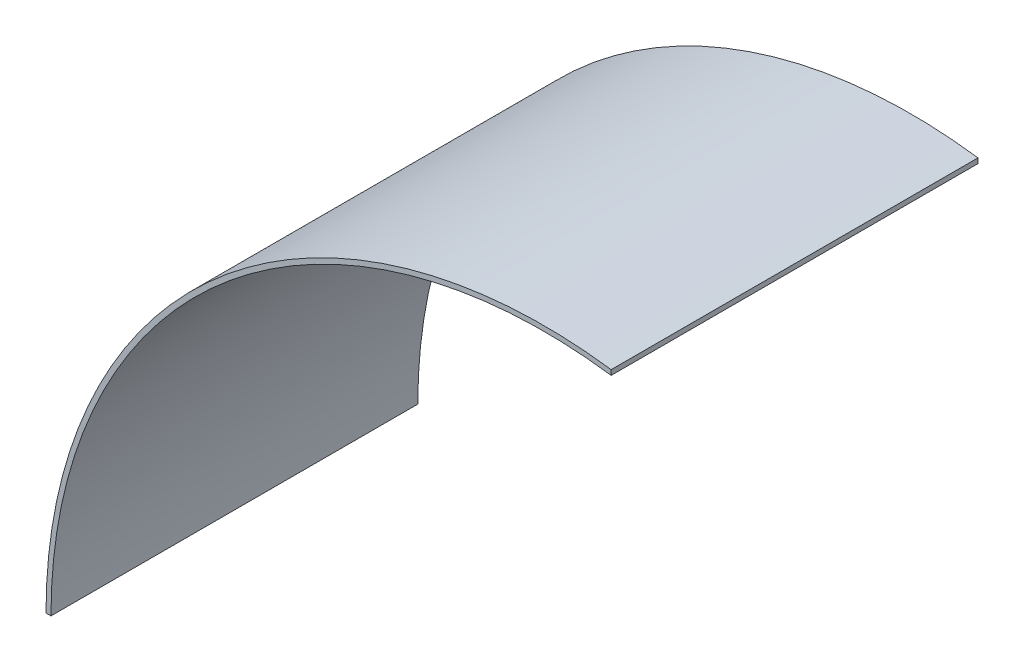
ISO-10303-21;
HEADER;
FILE_DESCRIPTION(('STEP AP214'),'2;1');
FILE_NAME('part.step','',(''),(''),'','','');
FILE_SCHEMA(('AUTOMOTIVE_DESIGN { 1 0 10303 214 1 1 1 1 }'));
ENDSEC;
DATA;
#1=APPLICATION_CONTEXT('core data for automotive mechanical design processes');
#2=APPLICATION_PROTOCOL_DEFINITION('international standard','automotive_design',2000,#1);
#3=PRODUCT_CONTEXT('',#1,'mechanical');
#4=PRODUCT('Part','Part','',(#3));
#5=PRODUCT_RELATED_PRODUCT_CATEGORY('part','',(#4));
#6=PRODUCT_DEFINITION_FORMATION('','',#4);
#7=PRODUCT_DEFINITION_CONTEXT('part definition',#1,'design');
#8=PRODUCT_DEFINITION('design','',#6,#7);
#9=PRODUCT_DEFINITION_SHAPE('','',#8);
#10=(LENGTH_UNIT() NAMED_UNIT(*) SI_UNIT(.MILLI.,.METRE.));
#11=(NAMED_UNIT(*) PLANE_ANGLE_UNIT() SI_UNIT($,.RADIAN.));
#12=(NAMED_UNIT(*) SI_UNIT($,.STERADIAN.) SOLID_ANGLE_UNIT());
#13=UNCERTAINTY_MEASURE_WITH_UNIT(LENGTH_MEASURE(1.E-05),#10,'distance_accuracy_value','');
#14=(GEOMETRIC_REPRESENTATION_CONTEXT(3) GLOBAL_UNCERTAINTY_ASSIGNED_CONTEXT((#13)) GLOBAL_UNIT_ASSIGNED_CONTEXT((#10,
#11,#12)) REPRESENTATION_CONTEXT('',''));
#15=CARTESIAN_POINT('',(0.,0.,0.));
#16=DIRECTION('',(0.,0.,1.));
#17=DIRECTION('',(1.,0.,0.));
#18=AXIS2_PLACEMENT_3D('',#15,#16,#17);
#19=CARTESIAN_POINT('',(0.,0.,112.268));
#20=DIRECTION('',(0.,0.,-1.));
#21=DIRECTION('',(-1.,0.,0.));
#22=AXIS2_PLACEMENT_3D('',#19,#20,#21);
#23=CYLINDRICAL_SURFACE('',#22,152.4);
#24=CARTESIAN_POINT('',(0.,0.,0.));
#25=DIRECTION('',(0.,0.,1.));
#26=DIRECTION('',(-1.,0.,0.));
#27=AXIS2_PLACEMENT_3D('',#24,#25,#26);
#28=CIRCLE('',#27,152.4);
#29=CARTESIAN_POINT('',(20.56892,151.005561255318,0.));
#30=VERTEX_POINT('',#29);
#31=CARTESIAN_POINT('',(-152.4,0.,0.));
#32=VERTEX_POINT('',#31);
#33=EDGE_CURVE('E97',#30,#32,#28,.T.);
#34=ORIENTED_EDGE('',*,*,#33,.T.);
#35=DIRECTION('',(0.,0.,-1.));
#36=VECTOR('',#35,1.);
#37=CARTESIAN_POINT('',(-152.4,0.,112.268));
#38=LINE('',#37,#36);
#39=CARTESIAN_POINT('',(-152.4,0.,112.268));
#40=VERTEX_POINT('',#39);
#41=EDGE_CURVE('E11',#40,#32,#38,.T.);
#42=ORIENTED_EDGE('',*,*,#41,.F.);
#43=CARTESIAN_POINT('',(0.,0.,112.268));
#44=DIRECTION('',(0.,0.,1.));
#45=DIRECTION('',(-1.,0.,0.));
#46=AXIS2_PLACEMENT_3D('',#43,#44,#45);
#47=CIRCLE('',#46,152.4);
#48=CARTESIAN_POINT('',(20.56892,151.005561255318,112.268));
#49=VERTEX_POINT('',#48);
#50=EDGE_CURVE('E85',#49,#40,#47,.T.);
#51=ORIENTED_EDGE('',*,*,#50,.F.);
#52=DIRECTION('',(0.,0.,-1.));
#53=VECTOR('',#52,1.);
#54=CARTESIAN_POINT('',(20.56892,151.005561255318,112.268));
#55=LINE('',#54,#53);
#56=EDGE_CURVE('E93',#49,#30,#55,.T.);
#57=ORIENTED_EDGE('',*,*,#56,.T.);
#58=EDGE_LOOP('',(#34,#42,#51,#57));
#59=FACE_BOUND('',#58,.T.);
#60=ADVANCED_FACE('F34',(#59),#23,.T.);
#61=CARTESIAN_POINT('',(-152.4,0.,112.268));
#62=DIRECTION('',(0.,1.,0.));
#63=DIRECTION('',(-1.,0.,0.));
#64=AXIS2_PLACEMENT_3D('',#61,#62,#63);
#65=PLANE('',#64);
#66=DIRECTION('',(1.,0.,0.));
#67=VECTOR('',#66,1.);
#68=CARTESIAN_POINT('',(-152.4,0.,0.));
#69=LINE('',#68,#67);
#70=CARTESIAN_POINT('',(-150.88108,0.,0.));
#71=VERTEX_POINT('',#70);
#72=EDGE_CURVE('E89',#32,#71,#69,.T.);
#73=ORIENTED_EDGE('',*,*,#72,.T.);
#74=DIRECTION('',(0.,0.,-1.));
#75=VECTOR('',#74,1.);
#76=CARTESIAN_POINT('',(-150.88108,0.,112.268));
#77=LINE('',#76,#75);
#78=CARTESIAN_POINT('',(-150.88108,0.,112.268));
#79=VERTEX_POINT('',#78);
#80=EDGE_CURVE('E42',#79,#71,#77,.T.);
#81=ORIENTED_EDGE('',*,*,#80,.F.);
#82=DIRECTION('',(1.,0.,0.));
#83=VECTOR('',#82,1.);
#84=CARTESIAN_POINT('',(-152.4,0.,112.268));
#85=LINE('',#84,#83);
#86=EDGE_CURVE('E80',#40,#79,#85,.T.);
#87=ORIENTED_EDGE('',*,*,#86,.F.);
#88=ORIENTED_EDGE('',*,*,#41,.T.);
#89=EDGE_LOOP('',(#73,#81,#87,#88));
#90=FACE_BOUND('',#89,.T.);
#91=ADVANCED_FACE('F88',(#90),#65,.F.);
#92=CARTESIAN_POINT('',(0.,0.,112.268));
#93=DIRECTION('',(0.,0.,-1.));
#94=DIRECTION('',(-1.,0.,0.));
#95=AXIS2_PLACEMENT_3D('',#92,#93,#94);
#96=CYLINDRICAL_SURFACE('',#95,150.88108);
#97=CARTESIAN_POINT('',(0.,0.,0.));
#98=DIRECTION('',(0.,0.,-1.));
#99=DIRECTION('',(-1.,0.,0.));
#100=AXIS2_PLACEMENT_3D('',#97,#98,#99);
#101=CIRCLE('',#100,150.88108);
#102=CARTESIAN_POINT('',(20.56892,149.472471820065,0.));
#103=VERTEX_POINT('',#102);
#104=EDGE_CURVE('E67',#71,#103,#101,.T.);
#105=ORIENTED_EDGE('',*,*,#104,.T.);
#106=DIRECTION('',(0.,0.,-1.));
#107=VECTOR('',#106,1.);
#108=CARTESIAN_POINT('',(20.56892,149.472471820065,112.268));
#109=LINE('',#108,#107);
#110=CARTESIAN_POINT('',(20.56892,149.472471820065,112.268));
#111=VERTEX_POINT('',#110);
#112=EDGE_CURVE('E90',#111,#103,#109,.T.);
#113=ORIENTED_EDGE('',*,*,#112,.F.);
#114=CARTESIAN_POINT('',(0.,0.,112.268));
#115=DIRECTION('',(0.,0.,-1.));
#116=DIRECTION('',(-1.,0.,0.));
#117=AXIS2_PLACEMENT_3D('',#114,#115,#116);
#118=CIRCLE('',#117,150.88108);
#119=EDGE_CURVE('E83',#79,#111,#118,.T.);
#120=ORIENTED_EDGE('',*,*,#119,.F.);
#121=ORIENTED_EDGE('',*,*,#80,.T.);
#122=EDGE_LOOP('',(#105,#113,#120,#121));
#123=FACE_BOUND('',#122,.T.);
#124=ADVANCED_FACE('F91',(#123),#96,.F.);
#125=CARTESIAN_POINT('',(20.56892,151.005561255318,112.268));
#126=DIRECTION('',(-1.,0.,0.));
#127=DIRECTION('',(0.,0.,1.));
#128=AXIS2_PLACEMENT_3D('',#125,#126,#127);
#129=PLANE('',#128);
#130=DIRECTION('',(0.,1.,0.));
#131=VECTOR('',#130,1.);
#132=CARTESIAN_POINT('',(20.56892,151.005561255318,0.));
#133=LINE('',#132,#131);
#134=EDGE_CURVE('E73',#103,#30,#133,.T.);
#135=ORIENTED_EDGE('',*,*,#134,.T.);
#136=ORIENTED_EDGE('',*,*,#56,.F.);
#137=DIRECTION('',(0.,1.,0.));
#138=VECTOR('',#137,1.);
#139=CARTESIAN_POINT('',(20.56892,151.005561255318,112.268));
#140=LINE('',#139,#138);
#141=EDGE_CURVE('E50',#111,#49,#140,.T.);
#142=ORIENTED_EDGE('',*,*,#141,.F.);
#143=ORIENTED_EDGE('',*,*,#112,.T.);
#144=EDGE_LOOP('',(#135,#136,#142,#143));
#145=FACE_BOUND('',#144,.T.);
#146=ADVANCED_FACE('F104',(#145),#129,.F.);
#147=CARTESIAN_POINT('',(0.,0.,112.268));
#148=DIRECTION('',(0.,0.,-1.));
#149=DIRECTION('',(-1.,0.,0.));
#150=AXIS2_PLACEMENT_3D('',#147,#148,#149);
#151=PLANE('',#150);
#152=ORIENTED_EDGE('',*,*,#50,.T.);
#153=ORIENTED_EDGE('',*,*,#86,.T.);
#154=ORIENTED_EDGE('',*,*,#119,.T.);
#155=ORIENTED_EDGE('',*,*,#141,.T.);
#156=EDGE_LOOP('',(#152,#153,#154,#155));
#157=FACE_BOUND('',#156,.T.);
#158=ADVANCED_FACE('F81',(#157),#151,.F.);
#159=CARTESIAN_POINT('',(0.,0.,0.));
#160=DIRECTION('',(0.,0.,-1.));
#161=DIRECTION('',(-1.,0.,0.));
#162=AXIS2_PLACEMENT_3D('',#159,#160,#161);
#163=PLANE('',#162);
#164=ORIENTED_EDGE('',*,*,#33,.F.);
#165=ORIENTED_EDGE('',*,*,#134,.F.);
#166=ORIENTED_EDGE('',*,*,#104,.F.);
#167=ORIENTED_EDGE('',*,*,#72,.F.);
#168=EDGE_LOOP('',(#164,#165,#166,#167));
#169=FACE_BOUND('',#168,.T.);
#170=ADVANCED_FACE('F107',(#169),#163,.T.);
#171=CLOSED_SHELL('',(#60,#91,#124,#146,#158,#170));
#172=MANIFOLD_SOLID_BREP('B2',#171);
#173=ADVANCED_BREP_SHAPE_REPRESENTATION('',(#18,#172),#14);
#174=SHAPE_DEFINITION_REPRESENTATION(#9,#173);
ENDSEC;
END-ISO-10303-21;
